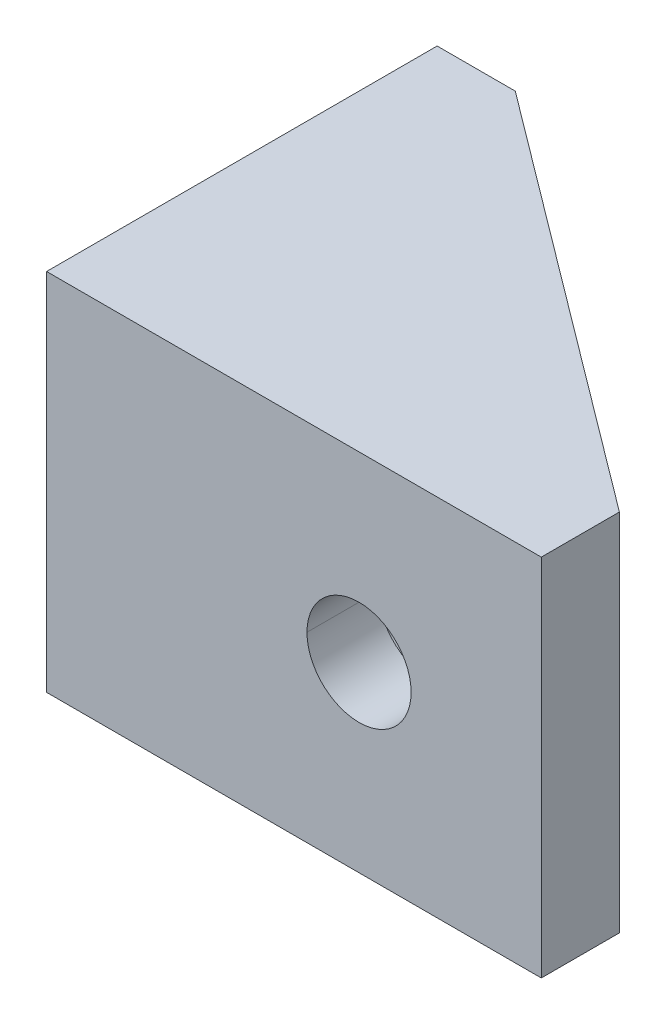
ISO-10303-21;
HEADER;
FILE_DESCRIPTION(('STEP AP214'),'2;1');
FILE_NAME('part.step','',(''),(''),'','','');
FILE_SCHEMA(('AUTOMOTIVE_DESIGN { 1 0 10303 214 1 1 1 1 }'));
ENDSEC;
DATA;
#1=APPLICATION_CONTEXT('core data for automotive mechanical design processes');
#2=APPLICATION_PROTOCOL_DEFINITION('international standard','automotive_design',2000,#1);
#3=PRODUCT_CONTEXT('',#1,'mechanical');
#4=PRODUCT('Part','Part','',(#3));
#5=PRODUCT_RELATED_PRODUCT_CATEGORY('part','',(#4));
#6=PRODUCT_DEFINITION_FORMATION('','',#4);
#7=PRODUCT_DEFINITION_CONTEXT('part definition',#1,'design');
#8=PRODUCT_DEFINITION('design','',#6,#7);
#9=PRODUCT_DEFINITION_SHAPE('','',#8);
#10=(LENGTH_UNIT() NAMED_UNIT(*) SI_UNIT(.MILLI.,.METRE.));
#11=(NAMED_UNIT(*) PLANE_ANGLE_UNIT() SI_UNIT($,.RADIAN.));
#12=(NAMED_UNIT(*) SI_UNIT($,.STERADIAN.) SOLID_ANGLE_UNIT());
#13=UNCERTAINTY_MEASURE_WITH_UNIT(LENGTH_MEASURE(1.E-05),#10,'distance_accuracy_value','');
#14=(GEOMETRIC_REPRESENTATION_CONTEXT(3) GLOBAL_UNCERTAINTY_ASSIGNED_CONTEXT((#13)) GLOBAL_UNIT_ASSIGNED_CONTEXT((#10,
#11,#12)) REPRESENTATION_CONTEXT('',''));
#15=CARTESIAN_POINT('',(0.,0.,0.));
#16=DIRECTION('',(0.,0.,1.));
#17=DIRECTION('',(1.,0.,0.));
#18=AXIS2_PLACEMENT_3D('',#15,#16,#17);
#19=CARTESIAN_POINT('',(0.,7.,-8.));
#20=DIRECTION('',(1.,0.,0.));
#21=DIRECTION('',(0.,0.,-1.));
#22=AXIS2_PLACEMENT_3D('',#19,#20,#21);
#23=CYLINDRICAL_SURFACE('',#22,2.);
#24=DIRECTION('',(1.,0.,0.));
#25=VECTOR('',#24,1.);
#26=CARTESIAN_POINT('',(0.,7.,-6.));
#27=LINE('',#26,#25);
#28=CARTESIAN_POINT('',(0.,7.,-6.));
#29=VERTEX_POINT('',#28);
#30=CARTESIAN_POINT('',(2.75,7.,-6.));
#31=VERTEX_POINT('',#30);
#32=EDGE_CURVE('E341',#29,#31,#27,.T.);
#33=ORIENTED_EDGE('',*,*,#32,.F.);
#34=CARTESIAN_POINT('',(0.,7.,-8.));
#35=DIRECTION('',(1.,0.,0.));
#36=DIRECTION('',(0.,0.,-1.));
#37=AXIS2_PLACEMENT_3D('',#34,#35,#36);
#38=CIRCLE('',#37,2.);
#39=CARTESIAN_POINT('',(0.,7.,-10.));
#40=VERTEX_POINT('',#39);
#41=EDGE_CURVE('E288',#40,#29,#38,.T.);
#42=ORIENTED_EDGE('',*,*,#41,.F.);
#43=DIRECTION('',(1.,0.,0.));
#44=VECTOR('',#43,1.);
#45=CARTESIAN_POINT('',(0.,7.,-10.));
#46=LINE('',#45,#44);
#47=CARTESIAN_POINT('',(2.75,7.,-10.));
#48=VERTEX_POINT('',#47);
#49=EDGE_CURVE('E322',#40,#48,#46,.T.);
#50=ORIENTED_EDGE('',*,*,#49,.T.);
#51=CARTESIAN_POINT('',(2.75,7.,-8.));
#52=DIRECTION('',(1.,0.,0.));
#53=DIRECTION('',(0.,0.,-1.));
#54=AXIS2_PLACEMENT_3D('',#51,#52,#53);
#55=CIRCLE('',#54,2.);
#56=EDGE_CURVE('E282',#48,#31,#55,.T.);
#57=ORIENTED_EDGE('',*,*,#56,.T.);
#58=EDGE_LOOP('',(#33,#42,#50,#57));
#59=FACE_BOUND('',#58,.T.);
#60=ADVANCED_FACE('F16',(#59),#23,.F.);
#61=CARTESIAN_POINT('',(12.,7.,0.));
#62=DIRECTION('',(0.,0.,-1.));
#63=DIRECTION('',(-1.,0.,0.));
#64=AXIS2_PLACEMENT_3D('',#61,#62,#63);
#65=CYLINDRICAL_SURFACE('',#64,2.);
#66=DIRECTION('',(0.,0.,-1.));
#67=VECTOR('',#66,1.);
#68=CARTESIAN_POINT('',(14.,7.,0.));
#69=LINE('',#68,#67);
#70=CARTESIAN_POINT('',(14.,7.,0.));
#71=VERTEX_POINT('',#70);
#72=CARTESIAN_POINT('',(14.,7.,-2.75));
#73=VERTEX_POINT('',#72);
#74=EDGE_CURVE('E289',#71,#73,#69,.T.);
#75=ORIENTED_EDGE('',*,*,#74,.F.);
#76=CARTESIAN_POINT('',(12.,7.,0.));
#77=DIRECTION('',(0.,0.,-1.));
#78=DIRECTION('',(-1.,0.,0.));
#79=AXIS2_PLACEMENT_3D('',#76,#77,#78);
#80=CIRCLE('',#79,2.);
#81=CARTESIAN_POINT('',(10.,7.,0.));
#82=VERTEX_POINT('',#81);
#83=EDGE_CURVE('E193',#82,#71,#80,.T.);
#84=ORIENTED_EDGE('',*,*,#83,.F.);
#85=DIRECTION('',(0.,0.,-1.));
#86=VECTOR('',#85,1.);
#87=CARTESIAN_POINT('',(10.,7.,0.));
#88=LINE('',#87,#86);
#89=CARTESIAN_POINT('',(10.,7.,-2.75));
#90=VERTEX_POINT('',#89);
#91=EDGE_CURVE('E199',#82,#90,#88,.T.);
#92=ORIENTED_EDGE('',*,*,#91,.T.);
#93=CARTESIAN_POINT('',(12.,7.,-2.75));
#94=DIRECTION('',(0.,0.,-1.));
#95=DIRECTION('',(-1.,0.,0.));
#96=AXIS2_PLACEMENT_3D('',#93,#94,#95);
#97=CIRCLE('',#96,2.);
#98=EDGE_CURVE('E11',#90,#73,#97,.T.);
#99=ORIENTED_EDGE('',*,*,#98,.T.);
#100=EDGE_LOOP('',(#75,#84,#92,#99));
#101=FACE_BOUND('',#100,.T.);
#102=ADVANCED_FACE('F429',(#101),#65,.F.);
#103=CARTESIAN_POINT('',(0.,14.,-2.75));
#104=DIRECTION('',(0.,0.,-1.));
#105=DIRECTION('',(0.,-1.,0.));
#106=AXIS2_PLACEMENT_3D('',#103,#104,#105);
#107=PLANE('',#106);
#108=ORIENTED_EDGE('',*,*,#98,.F.);
#109=CARTESIAN_POINT('',(12.,7.,-2.75));
#110=DIRECTION('',(0.,0.,-1.));
#111=DIRECTION('',(-1.,0.,0.));
#112=AXIS2_PLACEMENT_3D('',#109,#110,#111);
#113=CIRCLE('',#112,2.);
#114=EDGE_CURVE('E202',#73,#90,#113,.T.);
#115=ORIENTED_EDGE('',*,*,#114,.F.);
#116=EDGE_LOOP('',(#108,#115));
#117=FACE_BOUND('',#116,.T.);
#118=CARTESIAN_POINT('',(12.,7.,-2.75));
#119=DIRECTION('',(0.,0.,1.));
#120=DIRECTION('',(-1.,0.,0.));
#121=AXIS2_PLACEMENT_3D('',#118,#119,#120);
#122=CIRCLE('',#121,4.);
#123=CARTESIAN_POINT('',(8.,7.,-2.75));
#124=VERTEX_POINT('',#123);
#125=CARTESIAN_POINT('',(16.,7.,-2.75));
#126=VERTEX_POINT('',#125);
#127=EDGE_CURVE('E201',#124,#126,#122,.T.);
#128=ORIENTED_EDGE('',*,*,#127,.F.);
#129=CARTESIAN_POINT('',(12.,7.,-2.75));
#130=DIRECTION('',(0.,0.,1.));
#131=DIRECTION('',(-1.,0.,0.));
#132=AXIS2_PLACEMENT_3D('',#129,#130,#131);
#133=CIRCLE('',#132,4.);
#134=EDGE_CURVE('E27',#126,#124,#133,.T.);
#135=ORIENTED_EDGE('',*,*,#134,.F.);
#136=EDGE_LOOP('',(#128,#135));
#137=FACE_BOUND('',#136,.T.);
#138=ADVANCED_FACE('F434',(#117,#137),#107,.T.);
#139=CARTESIAN_POINT('',(12.,7.,11.3137084989848));
#140=DIRECTION('',(0.,0.,-1.));
#141=DIRECTION('',(-1.,0.,0.));
#142=AXIS2_PLACEMENT_3D('',#139,#140,#141);
#143=CYLINDRICAL_SURFACE('',#142,4.);
#144=DIRECTION('',(0.,0.,-1.));
#145=VECTOR('',#144,1.);
#146=CARTESIAN_POINT('',(16.,7.,11.3137084989848));
#147=LINE('',#146,#145);
#148=CARTESIAN_POINT('',(16.,7.,-4.));
#149=VERTEX_POINT('',#148);
#150=EDGE_CURVE('E247',#126,#149,#147,.T.);
#151=ORIENTED_EDGE('',*,*,#150,.F.);
#152=ORIENTED_EDGE('',*,*,#134,.T.);
#153=DIRECTION('',(0.,0.,-1.));
#154=VECTOR('',#153,1.);
#155=CARTESIAN_POINT('',(8.,7.,11.3137084989848));
#156=LINE('',#155,#154);
#157=CARTESIAN_POINT('',(8.,7.,-4.));
#158=VERTEX_POINT('',#157);
#159=EDGE_CURVE('E258',#124,#158,#156,.T.);
#160=ORIENTED_EDGE('',*,*,#159,.T.);
#161=CARTESIAN_POINT('',(12.,11.,-8.));
#162=CARTESIAN_POINT('',(9.65685424949239,11.,-5.65685424949239));
#163=CARTESIAN_POINT('',(8.,9.34314575050762,-4.00000000000001));
#164=CARTESIAN_POINT('',(8.,7.,-4.));
#165=(BOUNDED_CURVE() B_SPLINE_CURVE(3,(#161,#162,#163,#164),.UNSPECIFIED.,.F.,
.F.) B_SPLINE_CURVE_WITH_KNOTS((4,4),(1.5707963267949,3.1415926535898),
.UNSPECIFIED.) CURVE() GEOMETRIC_REPRESENTATION_ITEM() RATIONAL_B_SPLINE_CURVE((1.,
0.804737854124365,0.804737854124365,1.)) REPRESENTATION_ITEM(''));
#166=CARTESIAN_POINT('',(12.,11.,-8.));
#167=VERTEX_POINT('',#166);
#168=EDGE_CURVE('E374',#167,#158,#165,.T.);
#169=ORIENTED_EDGE('',*,*,#168,.F.);
#170=CARTESIAN_POINT('',(16.,7.,-4.));
#171=CARTESIAN_POINT('',(16.,9.34314575050762,-4.));
#172=CARTESIAN_POINT('',(14.3431457505076,11.,-5.65685424949239));
#173=CARTESIAN_POINT('',(12.,11.,-8.));
#174=(BOUNDED_CURVE() B_SPLINE_CURVE(3,(#170,#171,#172,#173),.UNSPECIFIED.,.F.,
.F.) B_SPLINE_CURVE_WITH_KNOTS((4,4),(0.,1.5707963267949),
.UNSPECIFIED.) CURVE() GEOMETRIC_REPRESENTATION_ITEM() RATIONAL_B_SPLINE_CURVE((1.,
0.804737854124365,0.804737854124365,1.)) REPRESENTATION_ITEM(''));
#175=EDGE_CURVE('E203',#149,#167,#174,.T.);
#176=ORIENTED_EDGE('',*,*,#175,.F.);
#177=EDGE_LOOP('',(#151,#152,#160,#169,#176));
#178=FACE_BOUND('',#177,.T.);
#179=ADVANCED_FACE('F437',(#178),#143,.F.);
#180=CARTESIAN_POINT('',(12.,7.,11.3137084989848));
#181=DIRECTION('',(0.,0.,-1.));
#182=DIRECTION('',(-1.,0.,0.));
#183=AXIS2_PLACEMENT_3D('',#180,#181,#182);
#184=CYLINDRICAL_SURFACE('',#183,4.);
#185=CARTESIAN_POINT('',(11.,10.8729833462074,-9.));
#186=CARTESIAN_POINT('',(11.3270796335738,10.9574349444551,-8.6729203664262));
#187=CARTESIAN_POINT('',(11.6621936070094,11.,-8.33780639299061));
#188=CARTESIAN_POINT('',(12.,11.,-8.));
#189=(BOUNDED_CURVE() B_SPLINE_CURVE(3,(#185,#186,#187,#188),.UNSPECIFIED.,.F.,
.F.) B_SPLINE_CURVE_WITH_KNOTS((4,4),(4.45970872524263,4.71238898038469),
.UNSPECIFIED.) CURVE() GEOMETRIC_REPRESENTATION_ITEM() RATIONAL_B_SPLINE_CURVE((1.,
0.994686464178112,0.994686464178112,1.)) REPRESENTATION_ITEM(''));
#190=CARTESIAN_POINT('',(11.,10.8729833462074,-9.));
#191=VERTEX_POINT('',#190);
#192=EDGE_CURVE('E42',#191,#167,#189,.T.);
#193=ORIENTED_EDGE('',*,*,#192,.F.);
#194=CARTESIAN_POINT('',(12.142857142863,10.9974481656095,-8.14285714285274));
#195=CARTESIAN_POINT('',(11.7572284283452,11.0112294115641,-8.43207867874109));
#196=CARTESIAN_POINT('',(11.3736217524961,10.9694520678873,-8.71978368562796));
#197=CARTESIAN_POINT('',(11.,10.8729833462074,-9.));
#198=(BOUNDED_CURVE() B_SPLINE_CURVE(3,(#194,#195,#196,#197),.UNSPECIFIED.,.F.,
.F.) B_SPLINE_CURVE_WITH_KNOTS((4,4),(4.67666709798515,4.96506923552676),
.UNSPECIFIED.) CURVE() GEOMETRIC_REPRESENTATION_ITEM() RATIONAL_B_SPLINE_CURVE((1.,
0.993080686385465,0.993080686385465,1.)) REPRESENTATION_ITEM(''));
#199=CARTESIAN_POINT('',(12.142857142863,10.9974481656095,-8.14285714285274));
#200=VERTEX_POINT('',#199);
#201=EDGE_CURVE('E359',#200,#191,#198,.T.);
#202=ORIENTED_EDGE('',*,*,#201,.F.);
#203=CARTESIAN_POINT('',(12.,11.,-8.));
#204=CARTESIAN_POINT('',(12.0476317090956,11.,-8.04763170909557));
#205=CARTESIAN_POINT('',(12.0952558208206,10.9991492980772,-8.09525582082065));
#206=CARTESIAN_POINT('',(12.142857142863,10.9974481656095,-8.14285714285274));
#207=(BOUNDED_CURVE() B_SPLINE_CURVE(3,(#203,#204,#205,#206),.UNSPECIFIED.,.F.,
.F.) B_SPLINE_CURVE_WITH_KNOTS((4,4),(4.71238898038469,4.74811086278295),
.UNSPECIFIED.) CURVE() GEOMETRIC_REPRESENTATION_ITEM() RATIONAL_B_SPLINE_CURVE((1.,
0.999893665086726,0.999893665086726,1.)) REPRESENTATION_ITEM(''));
#208=EDGE_CURVE('E208',#167,#200,#207,.T.);
#209=ORIENTED_EDGE('',*,*,#208,.F.);
#210=EDGE_LOOP('',(#193,#202,#209));
#211=FACE_BOUND('',#210,.T.);
#212=ADVANCED_FACE('F408',(#211),#184,.F.);
#213=CARTESIAN_POINT('',(12.,7.,11.3137084989848));
#214=DIRECTION('',(0.,0.,-1.));
#215=DIRECTION('',(-1.,0.,0.));
#216=AXIS2_PLACEMENT_3D('',#213,#214,#215);
#217=CYLINDRICAL_SURFACE('',#216,4.);
#218=CARTESIAN_POINT('',(12.1428571428571,3.00255183439051,-8.14285714285714));
#219=CARTESIAN_POINT('',(12.0952558208201,3.00085070192282,-8.09525582082016));
#220=CARTESIAN_POINT('',(12.0476317090953,3.,-8.04763170909532));
#221=CARTESIAN_POINT('',(12.,3.,-8.));
#222=(BOUNDED_CURVE() B_SPLINE_CURVE(3,(#218,#219,#220,#221),.UNSPECIFIED.,.F.,
.F.) B_SPLINE_CURVE_WITH_KNOTS((4,4),(1.53507444439682,1.5707963267949),
.UNSPECIFIED.) CURVE() GEOMETRIC_REPRESENTATION_ITEM() RATIONAL_B_SPLINE_CURVE((1.,
0.999893665086727,0.999893665086727,1.)) REPRESENTATION_ITEM(''));
#223=CARTESIAN_POINT('',(12.1428571428571,3.00255183439051,-8.14285714285714));
#224=VERTEX_POINT('',#223);
#225=CARTESIAN_POINT('',(12.,3.,-8.));
#226=VERTEX_POINT('',#225);
#227=EDGE_CURVE('E209',#224,#226,#222,.T.);
#228=ORIENTED_EDGE('',*,*,#227,.F.);
#229=CARTESIAN_POINT('',(10.9999999999942,3.12701665379383,-9.00000000000433));
#230=CARTESIAN_POINT('',(11.3736217524902,3.03054793211365,-8.71978368563238));
#231=CARTESIAN_POINT('',(11.7572284283393,2.98877058843624,-8.43207867874554));
#232=CARTESIAN_POINT('',(12.1428571428571,3.00255183439051,-8.14285714285714));
#233=(BOUNDED_CURVE() B_SPLINE_CURVE(3,(#229,#230,#231,#232),.UNSPECIFIED.,.F.,
.F.) B_SPLINE_CURVE_WITH_KNOTS((4,4),(1.31811607165134,1.60651820919298),
.UNSPECIFIED.) CURVE() GEOMETRIC_REPRESENTATION_ITEM() RATIONAL_B_SPLINE_CURVE((1.,
0.993080686385464,0.993080686385464,1.)) REPRESENTATION_ITEM(''));
#234=CARTESIAN_POINT('',(10.9999999999942,3.12701665379383,-9.00000000000433));
#235=VERTEX_POINT('',#234);
#236=EDGE_CURVE('E137',#235,#224,#233,.T.);
#237=ORIENTED_EDGE('',*,*,#236,.F.);
#238=CARTESIAN_POINT('',(12.,3.,-8.));
#239=CARTESIAN_POINT('',(11.6621936070076,3.,-8.33780639299239));
#240=CARTESIAN_POINT('',(11.3270796335703,3.04256505554536,-8.6729203664297));
#241=CARTESIAN_POINT('',(10.9999999999942,3.12701665379383,-9.00000000000433));
#242=(BOUNDED_CURVE() B_SPLINE_CURVE(3,(#238,#239,#240,#241),.UNSPECIFIED.,.F.,
.F.) B_SPLINE_CURVE_WITH_KNOTS((4,4),(1.5707963267949,1.82347658193827),
.UNSPECIFIED.) CURVE() GEOMETRIC_REPRESENTATION_ITEM() RATIONAL_B_SPLINE_CURVE((1.,
0.994686464178056,0.994686464178056,1.)) REPRESENTATION_ITEM(''));
#243=EDGE_CURVE('E263',#226,#235,#242,.T.);
#244=ORIENTED_EDGE('',*,*,#243,.F.);
#245=EDGE_LOOP('',(#228,#237,#244));
#246=FACE_BOUND('',#245,.T.);
#247=ADVANCED_FACE('F453',(#246),#217,.F.);
#248=CARTESIAN_POINT('',(2.75,14.,0.));
#249=DIRECTION('',(1.,0.,0.));
#250=DIRECTION('',(0.,1.,0.));
#251=AXIS2_PLACEMENT_3D('',#248,#249,#250);
#252=PLANE('',#251);
#253=ORIENTED_EDGE('',*,*,#56,.F.);
#254=CARTESIAN_POINT('',(2.75,7.,-8.));
#255=DIRECTION('',(1.,0.,0.));
#256=DIRECTION('',(0.,0.,-1.));
#257=AXIS2_PLACEMENT_3D('',#254,#255,#256);
#258=CIRCLE('',#257,2.);
#259=EDGE_CURVE('E330',#31,#48,#258,.T.);
#260=ORIENTED_EDGE('',*,*,#259,.F.);
#261=EDGE_LOOP('',(#253,#260));
#262=FACE_BOUND('',#261,.T.);
#263=CARTESIAN_POINT('',(2.75,7.,-8.));
#264=DIRECTION('',(-1.,0.,0.));
#265=DIRECTION('',(0.,0.,-1.));
#266=AXIS2_PLACEMENT_3D('',#263,#264,#265);
#267=CIRCLE('',#266,4.);
#268=CARTESIAN_POINT('',(2.75,7.,-12.));
#269=VERTEX_POINT('',#268);
#270=CARTESIAN_POINT('',(2.75,7.,-4.));
#271=VERTEX_POINT('',#270);
#272=EDGE_CURVE('E254',#269,#271,#267,.T.);
#273=ORIENTED_EDGE('',*,*,#272,.F.);
#274=CARTESIAN_POINT('',(2.75,7.,-8.));
#275=DIRECTION('',(-1.,0.,0.));
#276=DIRECTION('',(0.,0.,-1.));
#277=AXIS2_PLACEMENT_3D('',#274,#275,#276);
#278=CIRCLE('',#277,4.);
#279=EDGE_CURVE('E305',#271,#269,#278,.T.);
#280=ORIENTED_EDGE('',*,*,#279,.F.);
#281=EDGE_LOOP('',(#273,#280));
#282=FACE_BOUND('',#281,.T.);
#283=ADVANCED_FACE('F477',(#262,#282),#252,.T.);
#284=CARTESIAN_POINT('',(-11.3137084989848,7.,-8.));
#285=DIRECTION('',(1.,0.,0.));
#286=DIRECTION('',(0.,0.,-1.));
#287=AXIS2_PLACEMENT_3D('',#284,#285,#286);
#288=CYLINDRICAL_SURFACE('',#287,4.);
#289=DIRECTION('',(1.,0.,0.));
#290=VECTOR('',#289,1.);
#291=CARTESIAN_POINT('',(-11.3137084989848,7.,-4.));
#292=LINE('',#291,#290);
#293=EDGE_CURVE('E257',#271,#158,#292,.T.);
#294=ORIENTED_EDGE('',*,*,#293,.F.);
#295=ORIENTED_EDGE('',*,*,#279,.T.);
#296=DIRECTION('',(1.,0.,0.));
#297=VECTOR('',#296,1.);
#298=CARTESIAN_POINT('',(-11.3137084989848,7.,-12.));
#299=LINE('',#298,#297);
#300=CARTESIAN_POINT('',(7.,7.,-12.));
#301=VERTEX_POINT('',#300);
#302=EDGE_CURVE('E223',#269,#301,#299,.T.);
#303=ORIENTED_EDGE('',*,*,#302,.T.);
#304=CARTESIAN_POINT('',(11.,10.8729833462074,-9.));
#305=CARTESIAN_POINT('',(8.54970354689119,10.3984854783994,-10.8377223398316));
#306=CARTESIAN_POINT('',(6.99999999999998,8.89799147123235,-12.));
#307=CARTESIAN_POINT('',(7.,7.,-12.));
#308=(BOUNDED_CURVE() B_SPLINE_CURVE(3,(#304,#305,#306,#307),.UNSPECIFIED.,.F.,
.F.) B_SPLINE_CURVE_WITH_KNOTS((4,4),(1.82347658193696,3.1415926535898),
.UNSPECIFIED.) CURVE() GEOMETRIC_REPRESENTATION_ITEM() RATIONAL_B_SPLINE_CURVE((1.,
0.86037961002806,0.86037961002806,1.)) REPRESENTATION_ITEM(''));
#309=EDGE_CURVE('E121',#191,#301,#308,.T.);
#310=ORIENTED_EDGE('',*,*,#309,.F.);
#311=ORIENTED_EDGE('',*,*,#192,.T.);
#312=ORIENTED_EDGE('',*,*,#168,.T.);
#313=EDGE_LOOP('',(#294,#295,#303,#310,#311,#312));
#314=FACE_BOUND('',#313,.T.);
#315=ADVANCED_FACE('F407',(#314),#288,.F.);
#316=CARTESIAN_POINT('',(0.,0.,0.));
#317=DIRECTION('',(0.,-1.,0.));
#318=DIRECTION('',(0.,0.,-1.));
#319=AXIS2_PLACEMENT_3D('',#316,#317,#318);
#320=PLANE('',#319);
#321=DIRECTION('',(0.,0.,1.));
#322=VECTOR('',#321,1.);
#323=CARTESIAN_POINT('',(0.,0.,0.));
#324=LINE('',#323,#322);
#325=CARTESIAN_POINT('',(0.,0.,-15.));
#326=VERTEX_POINT('',#325);
#327=CARTESIAN_POINT('',(0.,0.,0.));
#328=VERTEX_POINT('',#327);
#329=EDGE_CURVE('E275',#326,#328,#324,.T.);
#330=ORIENTED_EDGE('',*,*,#329,.F.);
#331=DIRECTION('',(-1.,0.,0.));
#332=VECTOR('',#331,1.);
#333=CARTESIAN_POINT('',(0.,0.,-15.));
#334=LINE('',#333,#332);
#335=CARTESIAN_POINT('',(3.,0.,-15.));
#336=VERTEX_POINT('',#335);
#337=EDGE_CURVE('E306',#336,#326,#334,.T.);
#338=ORIENTED_EDGE('',*,*,#337,.F.);
#339=DIRECTION('',(-0.8,0.,-0.6));
#340=VECTOR('',#339,1.);
#341=CARTESIAN_POINT('',(3.,0.,-15.));
#342=LINE('',#341,#340);
#343=CARTESIAN_POINT('',(19.,0.,-3.));
#344=VERTEX_POINT('',#343);
#345=EDGE_CURVE('E181',#344,#336,#342,.T.);
#346=ORIENTED_EDGE('',*,*,#345,.F.);
#347=DIRECTION('',(0.,0.,-1.));
#348=VECTOR('',#347,1.);
#349=CARTESIAN_POINT('',(19.,0.,0.));
#350=LINE('',#349,#348);
#351=CARTESIAN_POINT('',(19.,0.,0.));
#352=VERTEX_POINT('',#351);
#353=EDGE_CURVE('E185',#352,#344,#350,.T.);
#354=ORIENTED_EDGE('',*,*,#353,.F.);
#355=DIRECTION('',(1.,0.,0.));
#356=VECTOR('',#355,1.);
#357=CARTESIAN_POINT('',(0.,0.,0.));
#358=LINE('',#357,#356);
#359=EDGE_CURVE('E283',#328,#352,#358,.T.);
#360=ORIENTED_EDGE('',*,*,#359,.F.);
#361=EDGE_LOOP('',(#330,#338,#346,#354,#360));
#362=FACE_BOUND('',#361,.T.);
#363=ADVANCED_FACE('F466',(#362),#320,.T.);
#364=CARTESIAN_POINT('',(0.,14.,0.));
#365=DIRECTION('',(0.,-1.,0.));
#366=DIRECTION('',(0.,0.,-1.));
#367=AXIS2_PLACEMENT_3D('',#364,#365,#366);
#368=PLANE('',#367);
#369=DIRECTION('',(0.,0.,1.));
#370=VECTOR('',#369,1.);
#371=CARTESIAN_POINT('',(0.,14.,0.));
#372=LINE('',#371,#370);
#373=CARTESIAN_POINT('',(0.,14.,-15.));
#374=VERTEX_POINT('',#373);
#375=CARTESIAN_POINT('',(0.,14.,0.));
#376=VERTEX_POINT('',#375);
#377=EDGE_CURVE('E197',#374,#376,#372,.T.);
#378=ORIENTED_EDGE('',*,*,#377,.T.);
#379=DIRECTION('',(1.,0.,0.));
#380=VECTOR('',#379,1.);
#381=CARTESIAN_POINT('',(0.,14.,0.));
#382=LINE('',#381,#380);
#383=CARTESIAN_POINT('',(19.,14.,0.));
#384=VERTEX_POINT('',#383);
#385=EDGE_CURVE('E176',#376,#384,#382,.T.);
#386=ORIENTED_EDGE('',*,*,#385,.T.);
#387=DIRECTION('',(0.,0.,-1.));
#388=VECTOR('',#387,1.);
#389=CARTESIAN_POINT('',(19.,14.,0.));
#390=LINE('',#389,#388);
#391=CARTESIAN_POINT('',(19.,14.,-3.));
#392=VERTEX_POINT('',#391);
#393=EDGE_CURVE('E172',#384,#392,#390,.T.);
#394=ORIENTED_EDGE('',*,*,#393,.T.);
#395=DIRECTION('',(-0.8,0.,-0.6));
#396=VECTOR('',#395,1.);
#397=CARTESIAN_POINT('',(3.,14.,-15.));
#398=LINE('',#397,#396);
#399=CARTESIAN_POINT('',(3.,14.,-15.));
#400=VERTEX_POINT('',#399);
#401=EDGE_CURVE('E159',#392,#400,#398,.T.);
#402=ORIENTED_EDGE('',*,*,#401,.T.);
#403=DIRECTION('',(-1.,0.,0.));
#404=VECTOR('',#403,1.);
#405=CARTESIAN_POINT('',(0.,14.,-15.));
#406=LINE('',#405,#404);
#407=EDGE_CURVE('E299',#400,#374,#406,.T.);
#408=ORIENTED_EDGE('',*,*,#407,.T.);
#409=EDGE_LOOP('',(#378,#386,#394,#402,#408));
#410=FACE_BOUND('',#409,.T.);
#411=ADVANCED_FACE('F174',(#410),#368,.F.);
#412=CARTESIAN_POINT('',(0.,14.,-15.));
#413=DIRECTION('',(0.,0.,1.));
#414=DIRECTION('',(1.,0.,0.));
#415=AXIS2_PLACEMENT_3D('',#412,#413,#414);
#416=PLANE('',#415);
#417=ORIENTED_EDGE('',*,*,#337,.T.);
#418=DIRECTION('',(0.,-1.,0.));
#419=VECTOR('',#418,1.);
#420=CARTESIAN_POINT('',(0.,14.,-15.));
#421=LINE('',#420,#419);
#422=EDGE_CURVE('E20',#374,#326,#421,.T.);
#423=ORIENTED_EDGE('',*,*,#422,.F.);
#424=ORIENTED_EDGE('',*,*,#407,.F.);
#425=DIRECTION('',(0.,-1.,0.));
#426=VECTOR('',#425,1.);
#427=CARTESIAN_POINT('',(3.,14.,-15.));
#428=LINE('',#427,#426);
#429=EDGE_CURVE('E167',#400,#336,#428,.T.);
#430=ORIENTED_EDGE('',*,*,#429,.T.);
#431=EDGE_LOOP('',(#417,#423,#424,#430));
#432=FACE_BOUND('',#431,.T.);
#433=ADVANCED_FACE('F18',(#432),#416,.F.);
#434=CARTESIAN_POINT('',(3.,14.,-15.));
#435=DIRECTION('',(-0.6,0.,0.8));
#436=DIRECTION('',(0.,1.,0.));
#437=AXIS2_PLACEMENT_3D('',#434,#435,#436);
#438=PLANE('',#437);
#439=ORIENTED_EDGE('',*,*,#309,.T.);
#440=CARTESIAN_POINT('',(7.,7.,-12.));
#441=CARTESIAN_POINT('',(6.99999999999998,5.10200852876957,-12.));
#442=CARTESIAN_POINT('',(8.54970354688849,3.60151452160339,-10.8377223398336));
#443=CARTESIAN_POINT('',(10.9999999999942,3.12701665379383,-9.00000000000433));
#444=(BOUNDED_CURVE() B_SPLINE_CURVE(3,(#440,#441,#442,#443),.UNSPECIFIED.,.F.,
.F.) B_SPLINE_CURVE_WITH_KNOTS((4,4),(3.1415926535898,4.45970872524148),
.UNSPECIFIED.) CURVE() GEOMETRIC_REPRESENTATION_ITEM() RATIONAL_B_SPLINE_CURVE((1.,
0.860379610028293,0.860379610028293,1.)) REPRESENTATION_ITEM(''));
#445=EDGE_CURVE('E231',#301,#235,#444,.T.);
#446=ORIENTED_EDGE('',*,*,#445,.T.);
#447=ORIENTED_EDGE('',*,*,#236,.T.);
#448=CARTESIAN_POINT('',(12.1428571428571,3.00255183439051,-8.14285714285714));
#449=CARTESIAN_POINT('',(15.354220648182,2.91647825769103,-5.7343345138635));
#450=CARTESIAN_POINT('',(17.6666666666649,4.58993985241221,-4.00000000000133));
#451=CARTESIAN_POINT('',(17.6666666666667,6.9999999999978,-4.));
#452=CARTESIAN_POINT('',(17.6666666666684,9.4100601475834,-3.99999999999868));
#453=CARTESIAN_POINT('',(15.354220648188,11.0835217423065,-5.734334513859));
#454=CARTESIAN_POINT('',(12.142857142863,10.9974481656095,-8.14285714285274));
#455=(BOUNDED_CURVE() B_SPLINE_CURVE(3,(#448,#449,#450,#451,#452,#453,#454),.UNSPECIFIED.,.F.,
.F.) B_SPLINE_CURVE_WITH_KNOTS((4,3,4),(4.67666709798661,6.28318530717904,7.88970351637146),
.UNSPECIFIED.) CURVE() GEOMETRIC_REPRESENTATION_ITEM() RATIONAL_B_SPLINE_CURVE((1.,
0.796243383219741,0.796243383219741,1.,0.796243383219741,0.796243383219741,1.)) REPRESENTATION_ITEM(''));
#456=EDGE_CURVE('E220',#224,#200,#455,.T.);
#457=ORIENTED_EDGE('',*,*,#456,.T.);
#458=ORIENTED_EDGE('',*,*,#201,.T.);
#459=EDGE_LOOP('',(#439,#446,#447,#457,#458));
#460=FACE_BOUND('',#459,.T.);
#461=ORIENTED_EDGE('',*,*,#345,.T.);
#462=ORIENTED_EDGE('',*,*,#429,.F.);
#463=ORIENTED_EDGE('',*,*,#401,.F.);
#464=DIRECTION('',(0.,-1.,0.));
#465=VECTOR('',#464,1.);
#466=CARTESIAN_POINT('',(19.,14.,-3.));
#467=LINE('',#466,#465);
#468=EDGE_CURVE('E164',#392,#344,#467,.T.);
#469=ORIENTED_EDGE('',*,*,#468,.T.);
#470=EDGE_LOOP('',(#461,#462,#463,#469));
#471=FACE_BOUND('',#470,.T.);
#472=ADVANCED_FACE('F162',(#460,#471),#438,.F.);
#473=CARTESIAN_POINT('',(19.,14.,0.));
#474=DIRECTION('',(-1.,0.,0.));
#475=DIRECTION('',(0.,0.,1.));
#476=AXIS2_PLACEMENT_3D('',#473,#474,#475);
#477=PLANE('',#476);
#478=ORIENTED_EDGE('',*,*,#353,.T.);
#479=ORIENTED_EDGE('',*,*,#468,.F.);
#480=ORIENTED_EDGE('',*,*,#393,.F.);
#481=DIRECTION('',(0.,-1.,0.));
#482=VECTOR('',#481,1.);
#483=CARTESIAN_POINT('',(19.,14.,0.));
#484=LINE('',#483,#482);
#485=EDGE_CURVE('E287',#384,#352,#484,.T.);
#486=ORIENTED_EDGE('',*,*,#485,.T.);
#487=EDGE_LOOP('',(#478,#479,#480,#486));
#488=FACE_BOUND('',#487,.T.);
#489=ADVANCED_FACE('F183',(#488),#477,.F.);
#490=CARTESIAN_POINT('',(0.,14.,0.));
#491=DIRECTION('',(0.,0.,-1.));
#492=DIRECTION('',(0.,-1.,0.));
#493=AXIS2_PLACEMENT_3D('',#490,#491,#492);
#494=PLANE('',#493);
#495=ORIENTED_EDGE('',*,*,#83,.T.);
#496=CARTESIAN_POINT('',(12.,7.,0.));
#497=DIRECTION('',(0.,0.,-1.));
#498=DIRECTION('',(-1.,0.,0.));
#499=AXIS2_PLACEMENT_3D('',#496,#497,#498);
#500=CIRCLE('',#499,2.);
#501=EDGE_CURVE('E293',#71,#82,#500,.T.);
#502=ORIENTED_EDGE('',*,*,#501,.T.);
#503=EDGE_LOOP('',(#495,#502));
#504=FACE_BOUND('',#503,.T.);
#505=ORIENTED_EDGE('',*,*,#359,.T.);
#506=ORIENTED_EDGE('',*,*,#485,.F.);
#507=ORIENTED_EDGE('',*,*,#385,.F.);
#508=DIRECTION('',(0.,-1.,0.));
#509=VECTOR('',#508,1.);
#510=CARTESIAN_POINT('',(0.,14.,0.));
#511=LINE('',#510,#509);
#512=EDGE_CURVE('E279',#376,#328,#511,.T.);
#513=ORIENTED_EDGE('',*,*,#512,.T.);
#514=EDGE_LOOP('',(#505,#506,#507,#513));
#515=FACE_BOUND('',#514,.T.);
#516=ADVANCED_FACE('F427',(#504,#515),#494,.F.);
#517=CARTESIAN_POINT('',(0.,14.,0.));
#518=DIRECTION('',(1.,0.,0.));
#519=DIRECTION('',(0.,1.,0.));
#520=AXIS2_PLACEMENT_3D('',#517,#518,#519);
#521=PLANE('',#520);
#522=ORIENTED_EDGE('',*,*,#41,.T.);
#523=CARTESIAN_POINT('',(0.,7.,-8.));
#524=DIRECTION('',(1.,0.,0.));
#525=DIRECTION('',(0.,0.,-1.));
#526=AXIS2_PLACEMENT_3D('',#523,#524,#525);
#527=CIRCLE('',#526,2.);
#528=EDGE_CURVE('E237',#29,#40,#527,.T.);
#529=ORIENTED_EDGE('',*,*,#528,.T.);
#530=EDGE_LOOP('',(#522,#529));
#531=FACE_BOUND('',#530,.T.);
#532=ORIENTED_EDGE('',*,*,#329,.T.);
#533=ORIENTED_EDGE('',*,*,#512,.F.);
#534=ORIENTED_EDGE('',*,*,#377,.F.);
#535=ORIENTED_EDGE('',*,*,#422,.T.);
#536=EDGE_LOOP('',(#532,#533,#534,#535));
#537=FACE_BOUND('',#536,.T.);
#538=ADVANCED_FACE('F482',(#531,#537),#521,.F.);
#539=CARTESIAN_POINT('',(-11.3137084989848,7.,-8.));
#540=DIRECTION('',(1.,0.,0.));
#541=DIRECTION('',(0.,0.,-1.));
#542=AXIS2_PLACEMENT_3D('',#539,#540,#541);
#543=CYLINDRICAL_SURFACE('',#542,4.);
#544=ORIENTED_EDGE('',*,*,#227,.T.);
#545=CARTESIAN_POINT('',(12.,3.,-8.));
#546=CARTESIAN_POINT('',(14.3431457505076,3.,-5.65685424949239));
#547=CARTESIAN_POINT('',(16.,4.65685424949238,-4.));
#548=CARTESIAN_POINT('',(16.,7.,-4.));
#549=(BOUNDED_CURVE() B_SPLINE_CURVE(3,(#545,#546,#547,#548),.UNSPECIFIED.,.F.,
.F.) B_SPLINE_CURVE_WITH_KNOTS((4,4),(4.71238898038469,6.28318530717959),
.UNSPECIFIED.) CURVE() GEOMETRIC_REPRESENTATION_ITEM() RATIONAL_B_SPLINE_CURVE((1.,
0.804737854124365,0.804737854124365,1.)) REPRESENTATION_ITEM(''));
#550=EDGE_CURVE('E239',#226,#149,#549,.T.);
#551=ORIENTED_EDGE('',*,*,#550,.T.);
#552=ORIENTED_EDGE('',*,*,#175,.T.);
#553=ORIENTED_EDGE('',*,*,#208,.T.);
#554=ORIENTED_EDGE('',*,*,#456,.F.);
#555=EDGE_LOOP('',(#544,#551,#552,#553,#554));
#556=FACE_BOUND('',#555,.T.);
#557=ADVANCED_FACE('F409',(#556),#543,.F.);
#558=CARTESIAN_POINT('',(-11.3137084989848,7.,-8.));
#559=DIRECTION('',(1.,0.,0.));
#560=DIRECTION('',(0.,0.,-1.));
#561=AXIS2_PLACEMENT_3D('',#558,#559,#560);
#562=CYLINDRICAL_SURFACE('',#561,4.);
#563=ORIENTED_EDGE('',*,*,#272,.T.);
#564=ORIENTED_EDGE('',*,*,#293,.T.);
#565=CARTESIAN_POINT('',(8.,7.,-4.));
#566=CARTESIAN_POINT('',(8.,4.65685424949238,-4.00000000000001));
#567=CARTESIAN_POINT('',(9.65685424949239,3.,-5.65685424949239));
#568=CARTESIAN_POINT('',(12.,3.,-8.));
#569=(BOUNDED_CURVE() B_SPLINE_CURVE(3,(#565,#566,#567,#568),.UNSPECIFIED.,.F.,
.F.) B_SPLINE_CURVE_WITH_KNOTS((4,4),(3.1415926535898,4.71238898038469),
.UNSPECIFIED.) CURVE() GEOMETRIC_REPRESENTATION_ITEM() RATIONAL_B_SPLINE_CURVE((1.,
0.804737854124365,0.804737854124365,1.)) REPRESENTATION_ITEM(''));
#570=EDGE_CURVE('E246',#158,#226,#569,.T.);
#571=ORIENTED_EDGE('',*,*,#570,.T.);
#572=ORIENTED_EDGE('',*,*,#243,.T.);
#573=ORIENTED_EDGE('',*,*,#445,.F.);
#574=ORIENTED_EDGE('',*,*,#302,.F.);
#575=EDGE_LOOP('',(#563,#564,#571,#572,#573,#574));
#576=FACE_BOUND('',#575,.T.);
#577=ADVANCED_FACE('F492',(#576),#562,.F.);
#578=CARTESIAN_POINT('',(12.,7.,11.3137084989848));
#579=DIRECTION('',(0.,0.,-1.));
#580=DIRECTION('',(-1.,0.,0.));
#581=AXIS2_PLACEMENT_3D('',#578,#579,#580);
#582=CYLINDRICAL_SURFACE('',#581,4.);
#583=ORIENTED_EDGE('',*,*,#127,.T.);
#584=ORIENTED_EDGE('',*,*,#150,.T.);
#585=ORIENTED_EDGE('',*,*,#550,.F.);
#586=ORIENTED_EDGE('',*,*,#570,.F.);
#587=ORIENTED_EDGE('',*,*,#159,.F.);
#588=EDGE_LOOP('',(#583,#584,#585,#586,#587));
#589=FACE_BOUND('',#588,.T.);
#590=ADVANCED_FACE('F443',(#589),#582,.F.);
#591=CARTESIAN_POINT('',(12.,7.,0.));
#592=DIRECTION('',(0.,0.,-1.));
#593=DIRECTION('',(-1.,0.,0.));
#594=AXIS2_PLACEMENT_3D('',#591,#592,#593);
#595=CYLINDRICAL_SURFACE('',#594,2.);
#596=ORIENTED_EDGE('',*,*,#501,.F.);
#597=ORIENTED_EDGE('',*,*,#74,.T.);
#598=ORIENTED_EDGE('',*,*,#114,.T.);
#599=ORIENTED_EDGE('',*,*,#91,.F.);
#600=EDGE_LOOP('',(#596,#597,#598,#599));
#601=FACE_BOUND('',#600,.T.);
#602=ADVANCED_FACE('F432',(#601),#595,.F.);
#603=CARTESIAN_POINT('',(0.,7.,-8.));
#604=DIRECTION('',(1.,0.,0.));
#605=DIRECTION('',(0.,0.,-1.));
#606=AXIS2_PLACEMENT_3D('',#603,#604,#605);
#607=CYLINDRICAL_SURFACE('',#606,2.);
#608=ORIENTED_EDGE('',*,*,#528,.F.);
#609=ORIENTED_EDGE('',*,*,#32,.T.);
#610=ORIENTED_EDGE('',*,*,#259,.T.);
#611=ORIENTED_EDGE('',*,*,#49,.F.);
#612=EDGE_LOOP('',(#608,#609,#610,#611));
#613=FACE_BOUND('',#612,.T.);
#614=ADVANCED_FACE('F490',(#613),#607,.F.);
#615=CLOSED_SHELL('',(#60,#102,#138,#179,#212,#247,#283,#315,#363,#411,#433,#472,#489,#516,#538,
#557,#577,#590,#602,#614));
#616=MANIFOLD_SOLID_BREP('B1',#615);
#617=ADVANCED_BREP_SHAPE_REPRESENTATION('',(#18,#616),#14);
#618=SHAPE_DEFINITION_REPRESENTATION(#9,#617);
ENDSEC;
END-ISO-10303-21;
